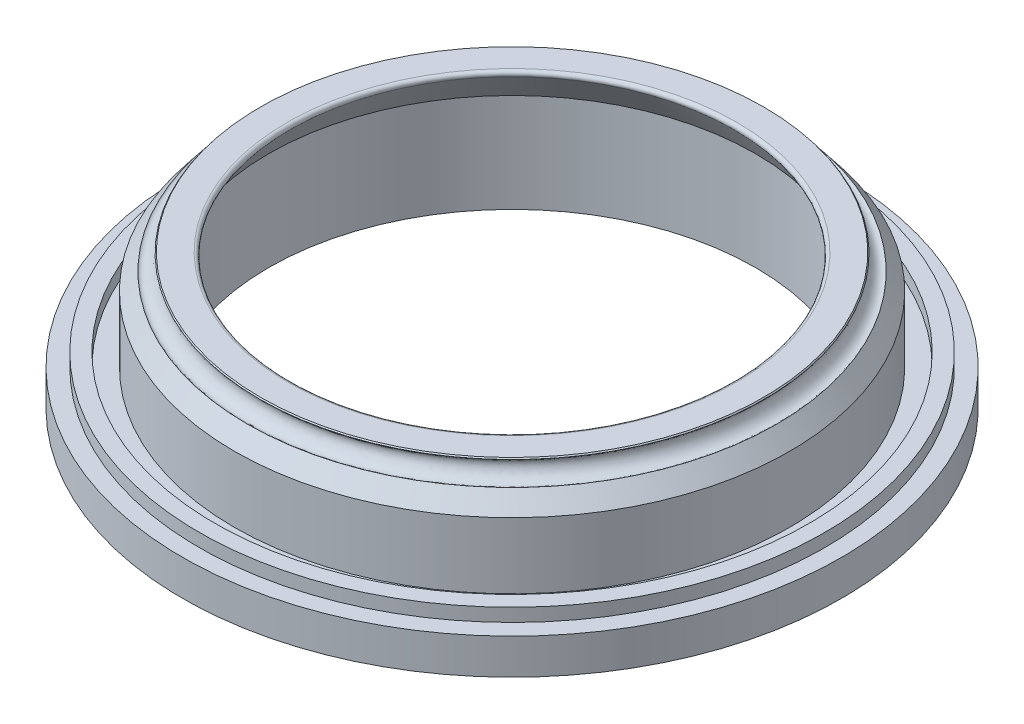
ISO-10303-21;
HEADER;
FILE_DESCRIPTION(('STEP AP214'),'2;1');
FILE_NAME('part.step','',(''),(''),'','','');
FILE_SCHEMA(('AUTOMOTIVE_DESIGN { 1 0 10303 214 1 1 1 1 }'));
ENDSEC;
DATA;
#1=APPLICATION_CONTEXT('core data for automotive mechanical design processes');
#2=APPLICATION_PROTOCOL_DEFINITION('international standard','automotive_design',2000,#1);
#3=PRODUCT_CONTEXT('',#1,'mechanical');
#4=PRODUCT('Part','Part','',(#3));
#5=PRODUCT_RELATED_PRODUCT_CATEGORY('part','',(#4));
#6=PRODUCT_DEFINITION_FORMATION('','',#4);
#7=PRODUCT_DEFINITION_CONTEXT('part definition',#1,'design');
#8=PRODUCT_DEFINITION('design','',#6,#7);
#9=PRODUCT_DEFINITION_SHAPE('','',#8);
#10=(LENGTH_UNIT() NAMED_UNIT(*) SI_UNIT(.MILLI.,.METRE.));
#11=(NAMED_UNIT(*) PLANE_ANGLE_UNIT() SI_UNIT($,.RADIAN.));
#12=(NAMED_UNIT(*) SI_UNIT($,.STERADIAN.) SOLID_ANGLE_UNIT());
#13=UNCERTAINTY_MEASURE_WITH_UNIT(LENGTH_MEASURE(1.E-05),#10,'distance_accuracy_value','');
#14=(GEOMETRIC_REPRESENTATION_CONTEXT(3) GLOBAL_UNCERTAINTY_ASSIGNED_CONTEXT((#13)) GLOBAL_UNIT_ASSIGNED_CONTEXT((#10,
#11,#12)) REPRESENTATION_CONTEXT('',''));
#15=CARTESIAN_POINT('',(0.,0.,0.));
#16=DIRECTION('',(0.,0.,1.));
#17=DIRECTION('',(1.,0.,0.));
#18=AXIS2_PLACEMENT_3D('',#15,#16,#17);
#19=CARTESIAN_POINT('',(78.7014235870721,-0.262378674365377,0.));
#20=DIRECTION('',(0.,0.,1.));
#21=DIRECTION('',(-1.,0.,0.));
#22=AXIS2_PLACEMENT_3D('',#19,#20,#21);
#23=ELLIPSE('',#22,3.,2.);
#24=CARTESIAN_POINT('',(0.,0.,0.));
#25=DIRECTION('',(0.,-1.,0.));
#26=AXIS1_PLACEMENT('',#24,#25);
#27=SURFACE_OF_REVOLUTION('',#23,#26);
#28=CARTESIAN_POINT('',(0.,-0.262378674365377,0.));
#29=DIRECTION('',(0.,-1.,0.));
#30=DIRECTION('',(0.,0.,-1.));
#31=AXIS2_PLACEMENT_3D('',#28,#29,#30);
#32=CIRCLE('',#31,75.701423587072);
#33=CARTESIAN_POINT('',(0.,-0.262378674365377,-75.701423587072));
#34=VERTEX_POINT('',#33);
#35=EDGE_CURVE('E97',#34,#34,#32,.T.);
#36=ORIENTED_EDGE('',*,*,#35,.F.);
#37=EDGE_LOOP('',(#36));
#38=FACE_BOUND('',#37,.T.);
#39=CARTESIAN_POINT('',(0.,-0.262378674365377,0.));
#40=DIRECTION('',(0.,-1.,0.));
#41=DIRECTION('',(0.,0.,-1.));
#42=AXIS2_PLACEMENT_3D('',#39,#40,#41);
#43=CIRCLE('',#42,81.7014235870721);
#44=CARTESIAN_POINT('',(0.,-0.262378674365377,-81.7014235870721));
#45=VERTEX_POINT('',#44);
#46=EDGE_CURVE('E52',#45,#45,#43,.T.);
#47=ORIENTED_EDGE('',*,*,#46,.T.);
#48=EDGE_LOOP('',(#47));
#49=FACE_BOUND('',#48,.T.);
#50=ADVANCED_FACE('F41',(#38,#49),#27,.T.);
#51=CARTESIAN_POINT('',(0.,-0.262378674365377,0.));
#52=DIRECTION('',(0.,-1.,0.));
#53=DIRECTION('',(0.,0.,-1.));
#54=AXIS2_PLACEMENT_3D('',#51,#52,#53);
#55=PLANE('',#54);
#56=CARTESIAN_POINT('',(0.,-0.262378674365377,85.));
#57=DIRECTION('',(0.,-1.,0.));
#58=DIRECTION('',(0.,0.,-1.));
#59=AXIS2_PLACEMENT_3D('',#56,#57,#58);
#60=CIRCLE('',#59,2.35);
#61=CARTESIAN_POINT('',(0.,-0.262378674365377,82.65));
#62=VERTEX_POINT('',#61);
#63=EDGE_CURVE('E277',#62,#62,#60,.T.);
#64=ORIENTED_EDGE('',*,*,#63,.F.);
#65=EDGE_LOOP('',(#64));
#66=FACE_BOUND('',#65,.T.);
#67=CARTESIAN_POINT('',(-42.4999999999991,-0.262378674365377,73.6121593216779));
#68=DIRECTION('',(0.,-1.,0.));
#69=DIRECTION('',(0.,0.,-1.));
#70=AXIS2_PLACEMENT_3D('',#67,#68,#69);
#71=CIRCLE('',#70,2.34999999999999);
#72=CARTESIAN_POINT('',(-42.4999999999991,-0.262378674365377,71.2621593216779));
#73=VERTEX_POINT('',#72);
#74=EDGE_CURVE('E296',#73,#73,#71,.T.);
#75=ORIENTED_EDGE('',*,*,#74,.F.);
#76=EDGE_LOOP('',(#75));
#77=FACE_BOUND('',#76,.T.);
#78=CARTESIAN_POINT('',(-73.6121593216768,-0.262378674365377,42.5000000000009));
#79=DIRECTION('',(0.,-1.,0.));
#80=DIRECTION('',(0.,0.,-1.));
#81=AXIS2_PLACEMENT_3D('',#78,#79,#80);
#82=CIRCLE('',#81,2.35);
#83=CARTESIAN_POINT('',(-73.6121593216768,-0.262378674365377,40.1500000000009));
#84=VERTEX_POINT('',#83);
#85=EDGE_CURVE('E290',#84,#84,#82,.T.);
#86=ORIENTED_EDGE('',*,*,#85,.F.);
#87=EDGE_LOOP('',(#86));
#88=FACE_BOUND('',#87,.T.);
#89=CARTESIAN_POINT('',(-85.,-0.262378674365377,8.90327741404999E-13));
#90=DIRECTION('',(0.,-1.,0.));
#91=DIRECTION('',(0.,0.,-1.));
#92=AXIS2_PLACEMENT_3D('',#89,#90,#91);
#93=CIRCLE('',#92,2.35);
#94=CARTESIAN_POINT('',(-85.,-0.262378674365377,-2.34999999999911));
#95=VERTEX_POINT('',#94);
#96=EDGE_CURVE('E283',#95,#95,#93,.T.);
#97=ORIENTED_EDGE('',*,*,#96,.F.);
#98=EDGE_LOOP('',(#97));
#99=FACE_BOUND('',#98,.T.);
#100=CARTESIAN_POINT('',(42.5000000000001,-0.262378674365377,73.6121593216773));
#101=DIRECTION('',(0.,-1.,0.));
#102=DIRECTION('',(0.,0.,-1.));
#103=AXIS2_PLACEMENT_3D('',#100,#101,#102);
#104=CIRCLE('',#103,2.35000000000001);
#105=CARTESIAN_POINT('',(42.5000000000001,-0.262378674365377,71.2621593216772));
#106=VERTEX_POINT('',#105);
#107=EDGE_CURVE('E280',#106,#106,#104,.T.);
#108=ORIENTED_EDGE('',*,*,#107,.F.);
#109=EDGE_LOOP('',(#108));
#110=FACE_BOUND('',#109,.T.);
#111=CARTESIAN_POINT('',(73.6121593216774,-0.262378674365377,42.4999999999998));
#112=DIRECTION('',(0.,-1.,0.));
#113=DIRECTION('',(0.,0.,-1.));
#114=AXIS2_PLACEMENT_3D('',#111,#112,#113);
#115=CIRCLE('',#114,2.35000000000001);
#116=CARTESIAN_POINT('',(73.6121593216774,-0.262378674365377,40.1499999999998));
#117=VERTEX_POINT('',#116);
#118=EDGE_CURVE('E331',#117,#117,#115,.T.);
#119=ORIENTED_EDGE('',*,*,#118,.F.);
#120=EDGE_LOOP('',(#119));
#121=FACE_BOUND('',#120,.T.);
#122=CARTESIAN_POINT('',(85.,-0.262378674365377,-2.96775913801666E-13));
#123=DIRECTION('',(0.,-1.,0.));
#124=DIRECTION('',(0.,0.,-1.));
#125=AXIS2_PLACEMENT_3D('',#122,#123,#124);
#126=CIRCLE('',#125,2.35);
#127=CARTESIAN_POINT('',(85.,-0.262378674365377,-2.3500000000003));
#128=VERTEX_POINT('',#127);
#129=EDGE_CURVE('E337',#128,#128,#126,.T.);
#130=ORIENTED_EDGE('',*,*,#129,.F.);
#131=EDGE_LOOP('',(#130));
#132=FACE_BOUND('',#131,.T.);
#133=CARTESIAN_POINT('',(73.6121593216771,-0.262378674365377,-42.5000000000003));
#134=DIRECTION('',(0.,-1.,0.));
#135=DIRECTION('',(0.,0.,-1.));
#136=AXIS2_PLACEMENT_3D('',#133,#134,#135);
#137=CIRCLE('',#136,2.35000000000001);
#138=CARTESIAN_POINT('',(73.6121593216771,-0.262378674365377,-44.8500000000003));
#139=VERTEX_POINT('',#138);
#140=EDGE_CURVE('E343',#139,#139,#137,.T.);
#141=ORIENTED_EDGE('',*,*,#140,.F.);
#142=EDGE_LOOP('',(#141));
#143=FACE_BOUND('',#142,.T.);
#144=CARTESIAN_POINT('',(42.4999999999996,-0.262378674365377,-73.6121593216776));
#145=DIRECTION('',(0.,-1.,0.));
#146=DIRECTION('',(0.,0.,-1.));
#147=AXIS2_PLACEMENT_3D('',#144,#145,#146);
#148=CIRCLE('',#147,2.34999999999999);
#149=CARTESIAN_POINT('',(42.4999999999996,-0.262378674365377,-75.9621593216775));
#150=VERTEX_POINT('',#149);
#151=EDGE_CURVE('E302',#150,#150,#148,.T.);
#152=ORIENTED_EDGE('',*,*,#151,.F.);
#153=EDGE_LOOP('',(#152));
#154=FACE_BOUND('',#153,.T.);
#155=CARTESIAN_POINT('',(-5.93551827603333E-13,-0.262378674365377,-85.));
#156=DIRECTION('',(0.,-1.,0.));
#157=DIRECTION('',(0.,0.,-1.));
#158=AXIS2_PLACEMENT_3D('',#155,#156,#157);
#159=CIRCLE('',#158,2.35);
#160=CARTESIAN_POINT('',(-5.93551827603333E-13,-0.262378674365377,-87.35));
#161=VERTEX_POINT('',#160);
#162=EDGE_CURVE('E309',#161,#161,#159,.T.);
#163=ORIENTED_EDGE('',*,*,#162,.F.);
#164=EDGE_LOOP('',(#163));
#165=FACE_BOUND('',#164,.T.);
#166=CARTESIAN_POINT('',(-42.5000000000006,-0.262378674365377,-73.6121593216769));
#167=DIRECTION('',(0.,-1.,0.));
#168=DIRECTION('',(0.,0.,-1.));
#169=AXIS2_PLACEMENT_3D('',#166,#167,#168);
#170=CIRCLE('',#169,2.35);
#171=CARTESIAN_POINT('',(-42.5000000000006,-0.262378674365377,-75.9621593216769));
#172=VERTEX_POINT('',#171);
#173=EDGE_CURVE('E315',#172,#172,#170,.T.);
#174=ORIENTED_EDGE('',*,*,#173,.F.);
#175=EDGE_LOOP('',(#174));
#176=FACE_BOUND('',#175,.T.);
#177=CARTESIAN_POINT('',(-73.6121593216777,-0.262378674365377,-42.4999999999993));
#178=DIRECTION('',(0.,-1.,0.));
#179=DIRECTION('',(0.,0.,-1.));
#180=AXIS2_PLACEMENT_3D('',#177,#178,#179);
#181=CIRCLE('',#180,2.35);
#182=CARTESIAN_POINT('',(-73.6121593216777,-0.262378674365377,-44.8499999999993));
#183=VERTEX_POINT('',#182);
#184=EDGE_CURVE('E321',#183,#183,#181,.T.);
#185=ORIENTED_EDGE('',*,*,#184,.F.);
#186=EDGE_LOOP('',(#185));
#187=FACE_BOUND('',#186,.T.);
#188=CARTESIAN_POINT('',(0.,-0.262378674365377,0.));
#189=DIRECTION('',(0.,-1.,0.));
#190=DIRECTION('',(0.,0.,-1.));
#191=AXIS2_PLACEMENT_3D('',#188,#189,#190);
#192=CIRCLE('',#191,100.);
#193=CARTESIAN_POINT('',(0.,-0.262378674365377,-100.));
#194=VERTEX_POINT('',#193);
#195=EDGE_CURVE('E56',#194,#194,#192,.T.);
#196=ORIENTED_EDGE('',*,*,#195,.T.);
#197=EDGE_LOOP('',(#196));
#198=FACE_BOUND('',#197,.T.);
#199=ORIENTED_EDGE('',*,*,#46,.F.);
#200=EDGE_LOOP('',(#199));
#201=FACE_BOUND('',#200,.T.);
#202=ADVANCED_FACE('F143',(#66,#77,#88,#99,#110,#121,#132,#143,#154,#165,#176,#187,#198,#201),
#55,.T.);
#203=CARTESIAN_POINT('',(0.,0.,0.));
#204=DIRECTION('',(0.,-1.,0.));
#205=DIRECTION('',(0.,0.,-1.));
#206=AXIS2_PLACEMENT_3D('',#203,#204,#205);
#207=CYLINDRICAL_SURFACE('',#206,100.);
#208=ORIENTED_EDGE('',*,*,#195,.F.);
#209=EDGE_LOOP('',(#208));
#210=FACE_BOUND('',#209,.T.);
#211=CARTESIAN_POINT('',(0.,10.5257606573878,0.));
#212=DIRECTION('',(0.,-1.,0.));
#213=DIRECTION('',(0.,0.,-1.));
#214=AXIS2_PLACEMENT_3D('',#211,#212,#213);
#215=CIRCLE('',#214,100.);
#216=CARTESIAN_POINT('',(0.,10.5257606573878,-100.));
#217=VERTEX_POINT('',#216);
#218=EDGE_CURVE('E61',#217,#217,#215,.T.);
#219=ORIENTED_EDGE('',*,*,#218,.T.);
#220=EDGE_LOOP('',(#219));
#221=FACE_BOUND('',#220,.T.);
#222=ADVANCED_FACE('F140',(#210,#221),#207,.T.);
#223=CARTESIAN_POINT('',(0.,10.5257606573878,0.));
#224=DIRECTION('',(0.,-1.,0.));
#225=DIRECTION('',(0.,0.,-1.));
#226=AXIS2_PLACEMENT_3D('',#223,#224,#225);
#227=PLANE('',#226);
#228=ORIENTED_EDGE('',*,*,#218,.F.);
#229=EDGE_LOOP('',(#228));
#230=FACE_BOUND('',#229,.T.);
#231=CARTESIAN_POINT('',(0.,10.5257606573878,0.));
#232=DIRECTION('',(0.,-1.,0.));
#233=DIRECTION('',(0.,0.,-1.));
#234=AXIS2_PLACEMENT_3D('',#231,#232,#233);
#235=CIRCLE('',#234,94.9);
#236=CARTESIAN_POINT('',(0.,10.5257606573878,-94.9));
#237=VERTEX_POINT('',#236);
#238=EDGE_CURVE('E64',#237,#237,#235,.T.);
#239=ORIENTED_EDGE('',*,*,#238,.T.);
#240=EDGE_LOOP('',(#239));
#241=FACE_BOUND('',#240,.T.);
#242=ADVANCED_FACE('F136',(#230,#241),#227,.F.);
#243=CARTESIAN_POINT('',(0.,0.,0.));
#244=DIRECTION('',(0.,-1.,0.));
#245=DIRECTION('',(0.,0.,-1.));
#246=AXIS2_PLACEMENT_3D('',#243,#244,#245);
#247=CYLINDRICAL_SURFACE('',#246,94.9);
#248=ORIENTED_EDGE('',*,*,#238,.F.);
#249=EDGE_LOOP('',(#248));
#250=FACE_BOUND('',#249,.T.);
#251=CARTESIAN_POINT('',(0.,14.5257606573878,0.));
#252=DIRECTION('',(0.,-1.,0.));
#253=DIRECTION('',(0.,0.,-1.));
#254=AXIS2_PLACEMENT_3D('',#251,#252,#253);
#255=CIRCLE('',#254,94.9);
#256=CARTESIAN_POINT('',(0.,14.5257606573878,-94.9));
#257=VERTEX_POINT('',#256);
#258=EDGE_CURVE('E67',#257,#257,#255,.T.);
#259=ORIENTED_EDGE('',*,*,#258,.T.);
#260=EDGE_LOOP('',(#259));
#261=FACE_BOUND('',#260,.T.);
#262=ADVANCED_FACE('F132',(#250,#261),#247,.T.);
#263=CARTESIAN_POINT('',(0.,14.5257606573878,0.));
#264=DIRECTION('',(0.,-1.,0.));
#265=DIRECTION('',(0.,0.,-1.));
#266=AXIS2_PLACEMENT_3D('',#263,#264,#265);
#267=PLANE('',#266);
#268=ORIENTED_EDGE('',*,*,#258,.F.);
#269=EDGE_LOOP('',(#268));
#270=FACE_BOUND('',#269,.T.);
#271=CARTESIAN_POINT('',(0.,14.5257606573878,0.));
#272=DIRECTION('',(0.,-1.,0.));
#273=DIRECTION('',(0.,0.,-1.));
#274=AXIS2_PLACEMENT_3D('',#271,#272,#273);
#275=CIRCLE('',#274,90.15);
#276=CARTESIAN_POINT('',(0.,14.5257606573878,-90.15));
#277=VERTEX_POINT('',#276);
#278=EDGE_CURVE('E70',#277,#277,#275,.T.);
#279=ORIENTED_EDGE('',*,*,#278,.T.);
#280=EDGE_LOOP('',(#279));
#281=FACE_BOUND('',#280,.T.);
#282=ADVANCED_FACE('F128',(#270,#281),#267,.F.);
#283=CARTESIAN_POINT('',(0.,0.,0.));
#284=DIRECTION('',(0.,-1.,0.));
#285=DIRECTION('',(0.,0.,-1.));
#286=AXIS2_PLACEMENT_3D('',#283,#284,#285);
#287=CYLINDRICAL_SURFACE('',#286,90.15);
#288=ORIENTED_EDGE('',*,*,#278,.F.);
#289=EDGE_LOOP('',(#288));
#290=FACE_BOUND('',#289,.T.);
#291=CARTESIAN_POINT('',(0.,10.5257606573878,0.));
#292=DIRECTION('',(0.,-1.,0.));
#293=DIRECTION('',(0.,0.,-1.));
#294=AXIS2_PLACEMENT_3D('',#291,#292,#293);
#295=CIRCLE('',#294,90.15);
#296=CARTESIAN_POINT('',(0.,10.5257606573878,-90.15));
#297=VERTEX_POINT('',#296);
#298=EDGE_CURVE('E73',#297,#297,#295,.T.);
#299=ORIENTED_EDGE('',*,*,#298,.T.);
#300=EDGE_LOOP('',(#299));
#301=FACE_BOUND('',#300,.T.);
#302=ADVANCED_FACE('F124',(#290,#301),#287,.F.);
#303=CARTESIAN_POINT('',(0.,10.5257606573878,0.));
#304=DIRECTION('',(0.,-1.,0.));
#305=DIRECTION('',(0.,0.,-1.));
#306=AXIS2_PLACEMENT_3D('',#303,#304,#305);
#307=PLANE('',#306);
#308=ORIENTED_EDGE('',*,*,#298,.F.);
#309=EDGE_LOOP('',(#308));
#310=FACE_BOUND('',#309,.T.);
#311=CARTESIAN_POINT('',(0.,10.5257606573878,0.));
#312=DIRECTION('',(0.,-1.,0.));
#313=DIRECTION('',(0.,0.,-1.));
#314=AXIS2_PLACEMENT_3D('',#311,#312,#313);
#315=CIRCLE('',#314,84.25);
#316=CARTESIAN_POINT('',(0.,10.5257606573878,-84.25));
#317=VERTEX_POINT('',#316);
#318=EDGE_CURVE('E76',#317,#317,#315,.T.);
#319=ORIENTED_EDGE('',*,*,#318,.T.);
#320=EDGE_LOOP('',(#319));
#321=FACE_BOUND('',#320,.T.);
#322=ADVANCED_FACE('F120',(#310,#321),#307,.F.);
#323=CARTESIAN_POINT('',(0.,0.,0.));
#324=DIRECTION('',(0.,-1.,0.));
#325=DIRECTION('',(0.,0.,-1.));
#326=AXIS2_PLACEMENT_3D('',#323,#324,#325);
#327=CYLINDRICAL_SURFACE('',#326,84.25);
#328=ORIENTED_EDGE('',*,*,#318,.F.);
#329=EDGE_LOOP('',(#328));
#330=FACE_BOUND('',#329,.T.);
#331=CARTESIAN_POINT('',(0.,30.5257606573879,0.));
#332=DIRECTION('',(0.,-1.,0.));
#333=DIRECTION('',(0.,0.,-1.));
#334=AXIS2_PLACEMENT_3D('',#331,#332,#333);
#335=CIRCLE('',#334,84.25);
#336=CARTESIAN_POINT('',(0.,30.5257606573879,-84.25));
#337=VERTEX_POINT('',#336);
#338=EDGE_CURVE('E79',#337,#337,#335,.T.);
#339=ORIENTED_EDGE('',*,*,#338,.T.);
#340=EDGE_LOOP('',(#339));
#341=FACE_BOUND('',#340,.T.);
#342=ADVANCED_FACE('F116',(#330,#341),#327,.T.);
#343=CARTESIAN_POINT('',(0.,35.6546539299251,0.));
#344=DIRECTION('',(0.,-1.,0.));
#345=DIRECTION('',(0.,0.,-1.));
#346=AXIS2_PLACEMENT_3D('',#343,#344,#345);
#347=CONICAL_SURFACE('',#346,80.2744893178467,0.659385391403463);
#348=ORIENTED_EDGE('',*,*,#338,.F.);
#349=EDGE_LOOP('',(#348));
#350=FACE_BOUND('',#349,.T.);
#351=CARTESIAN_POINT('',(0.,35.6546539299251,0.));
#352=DIRECTION('',(0.,-1.,0.));
#353=DIRECTION('',(0.,0.,-1.));
#354=AXIS2_PLACEMENT_3D('',#351,#352,#353);
#355=CIRCLE('',#354,80.2744893178467);
#356=CARTESIAN_POINT('',(0.,35.6546539299251,-80.2744893178467));
#357=VERTEX_POINT('',#356);
#358=EDGE_CURVE('E82',#357,#357,#355,.T.);
#359=ORIENTED_EDGE('',*,*,#358,.T.);
#360=EDGE_LOOP('',(#359));
#361=FACE_BOUND('',#360,.T.);
#362=ADVANCED_FACE('F111',(#350,#361),#347,.T.);
#363=CARTESIAN_POINT('',(78.4365957172863,38.0257606573879,0.));
#364=DIRECTION('',(0.,0.,1.));
#365=DIRECTION('',(0.6126312001868,-0.790368909154251,0.));
#366=AXIS2_PLACEMENT_3D('',#363,#364,#365);
#367=ELLIPSE('',#366,3.,2.);
#368=CARTESIAN_POINT('',(0.,0.,0.));
#369=DIRECTION('',(0.,-1.,0.));
#370=AXIS1_PLACEMENT('',#368,#369);
#371=SURFACE_OF_REVOLUTION('',#367,#370);
#372=ORIENTED_EDGE('',*,*,#358,.F.);
#373=EDGE_LOOP('',(#372));
#374=FACE_BOUND('',#373,.T.);
#375=CARTESIAN_POINT('',(0.,40.3968673848506,0.));
#376=DIRECTION('',(0.,-1.,0.));
#377=DIRECTION('',(0.,0.,-1.));
#378=AXIS2_PLACEMENT_3D('',#375,#376,#377);
#379=CIRCLE('',#378,76.5987021167259);
#380=CARTESIAN_POINT('',(0.,40.3968673848506,-76.5987021167259));
#381=VERTEX_POINT('',#380);
#382=EDGE_CURVE('E85',#381,#381,#379,.T.);
#383=ORIENTED_EDGE('',*,*,#382,.T.);
#384=EDGE_LOOP('',(#383));
#385=FACE_BOUND('',#384,.T.);
#386=ADVANCED_FACE('F106',(#374,#385),#371,.T.);
#387=CARTESIAN_POINT('',(0.,40.74810371,0.));
#388=DIRECTION('',(0.,-1.,0.));
#389=DIRECTION('',(0.,0.,-1.));
#390=AXIS2_PLACEMENT_3D('',#387,#388,#389);
#391=CONICAL_SURFACE('',#390,76.3264516158101,0.659385391403478);
#392=ORIENTED_EDGE('',*,*,#382,.F.);
#393=EDGE_LOOP('',(#392));
#394=FACE_BOUND('',#393,.T.);
#395=CARTESIAN_POINT('',(0.,40.74810371,0.));
#396=DIRECTION('',(0.,-1.,0.));
#397=DIRECTION('',(0.,0.,-1.));
#398=AXIS2_PLACEMENT_3D('',#395,#396,#397);
#399=CIRCLE('',#398,76.3264516158101);
#400=CARTESIAN_POINT('',(0.,40.74810371,-76.3264516158101));
#401=VERTEX_POINT('',#400);
#402=EDGE_CURVE('E88',#401,#401,#399,.T.);
#403=ORIENTED_EDGE('',*,*,#402,.T.);
#404=EDGE_LOOP('',(#403));
#405=FACE_BOUND('',#404,.T.);
#406=ADVANCED_FACE('F110',(#394,#405),#391,.T.);
#407=CARTESIAN_POINT('',(0.,40.74810371,0.));
#408=DIRECTION('',(0.,-1.,0.));
#409=DIRECTION('',(0.,0.,-1.));
#410=AXIS2_PLACEMENT_3D('',#407,#408,#409);
#411=PLANE('',#410);
#412=CARTESIAN_POINT('',(0.,40.74810371,0.));
#413=DIRECTION('',(0.,-1.,0.));
#414=DIRECTION('',(0.,0.,-1.));
#415=AXIS2_PLACEMENT_3D('',#412,#413,#414);
#416=CIRCLE('',#415,68.2179773977924);
#417=CARTESIAN_POINT('',(0.,40.74810371,-68.2179773977924));
#418=VERTEX_POINT('',#417);
#419=EDGE_CURVE('E48',#418,#418,#416,.T.);
#420=ORIENTED_EDGE('',*,*,#419,.T.);
#421=EDGE_LOOP('',(#420));
#422=FACE_BOUND('',#421,.T.);
#423=ORIENTED_EDGE('',*,*,#402,.F.);
#424=EDGE_LOOP('',(#423));
#425=FACE_BOUND('',#424,.T.);
#426=ADVANCED_FACE('F171',(#422,#425),#411,.F.);
#427=CARTESIAN_POINT('',(0.,40.74810371,0.));
#428=DIRECTION('',(0.,-1.,0.));
#429=DIRECTION('',(0.,0.,-1.));
#430=AXIS2_PLACEMENT_3D('',#427,#428,#429);
#431=CONICAL_SURFACE('',#430,66.3264516158101,0.598151137095569);
#432=CARTESIAN_POINT('',(0.,39.1849881331945,0.));
#433=DIRECTION('',(0.,-1.,0.));
#434=DIRECTION('',(0.,0.,-1.));
#435=AXIS2_PLACEMENT_3D('',#432,#433,#434);
#436=CIRCLE('',#435,67.3915992475736);
#437=CARTESIAN_POINT('',(0.,39.1849881331945,-67.3915992475736));
#438=VERTEX_POINT('',#437);
#439=EDGE_CURVE('E10',#438,#438,#436,.F.);
#440=ORIENTED_EDGE('',*,*,#439,.T.);
#441=EDGE_LOOP('',(#440));
#442=FACE_BOUND('',#441,.T.);
#443=CARTESIAN_POINT('',(0.,29.6746638875515,0.));
#444=DIRECTION('',(0.,-1.,0.));
#445=DIRECTION('',(0.,0.,-1.));
#446=AXIS2_PLACEMENT_3D('',#443,#444,#445);
#447=CIRCLE('',#446,73.8721816804167);
#448=CARTESIAN_POINT('',(0.,29.6746638875515,-73.8721816804167));
#449=VERTEX_POINT('',#448);
#450=EDGE_CURVE('E91',#449,#449,#447,.T.);
#451=ORIENTED_EDGE('',*,*,#450,.T.);
#452=EDGE_LOOP('',(#451));
#453=FACE_BOUND('',#452,.T.);
#454=ADVANCED_FACE('F166',(#442,#453),#431,.F.);
#455=CARTESIAN_POINT('',(0.,0.,0.));
#456=DIRECTION('',(0.,-1.,0.));
#457=DIRECTION('',(0.,0.,-1.));
#458=AXIS2_PLACEMENT_3D('',#455,#456,#457);
#459=CYLINDRICAL_SURFACE('',#458,73.8721816804167);
#460=CARTESIAN_POINT('',(0.,-0.262378674365377,0.));
#461=DIRECTION('',(0.,-1.,0.));
#462=DIRECTION('',(0.,0.,-1.));
#463=AXIS2_PLACEMENT_3D('',#460,#461,#462);
#464=CIRCLE('',#463,73.8721816804167);
#465=CARTESIAN_POINT('',(0.,-0.262378674365377,-73.8721816804167));
#466=VERTEX_POINT('',#465);
#467=EDGE_CURVE('E94',#466,#466,#464,.T.);
#468=ORIENTED_EDGE('',*,*,#467,.T.);
#469=EDGE_LOOP('',(#468));
#470=FACE_BOUND('',#469,.T.);
#471=ORIENTED_EDGE('',*,*,#450,.F.);
#472=EDGE_LOOP('',(#471));
#473=FACE_BOUND('',#472,.T.);
#474=ADVANCED_FACE('F161',(#470,#473),#459,.F.);
#475=ORIENTED_EDGE('',*,*,#35,.T.);
#476=EDGE_LOOP('',(#475));
#477=FACE_BOUND('',#476,.T.);
#478=ORIENTED_EDGE('',*,*,#467,.F.);
#479=EDGE_LOOP('',(#478));
#480=FACE_BOUND('',#479,.T.);
#481=ADVANCED_FACE('F152',(#477,#480),#55,.T.);
#482=CARTESIAN_POINT('',(-73.6121593216777,4.73762132563462,-42.4999999999993));
#483=DIRECTION('',(0.,-1.,0.));
#484=DIRECTION('',(0.,0.,-1.));
#485=AXIS2_PLACEMENT_3D('',#482,#483,#484);
#486=CYLINDRICAL_SURFACE('',#485,2.35);
#487=CARTESIAN_POINT('',(-73.6121593216777,4.73762132563462,-42.4999999999993));
#488=DIRECTION('',(0.,-1.,0.));
#489=DIRECTION('',(0.,0.,-1.));
#490=AXIS2_PLACEMENT_3D('',#487,#488,#489);
#491=CIRCLE('',#490,2.35);
#492=CARTESIAN_POINT('',(-73.6121593216777,4.73762132563462,-44.8499999999993));
#493=VERTEX_POINT('',#492);
#494=EDGE_CURVE('E286',#493,#493,#491,.T.);
#495=ORIENTED_EDGE('',*,*,#494,.F.);
#496=EDGE_LOOP('',(#495));
#497=FACE_BOUND('',#496,.T.);
#498=ORIENTED_EDGE('',*,*,#184,.T.);
#499=EDGE_LOOP('',(#498));
#500=FACE_BOUND('',#499,.T.);
#501=ADVANCED_FACE('F160',(#497,#500),#486,.F.);
#502=CARTESIAN_POINT('',(-73.6121593216777,4.73762132563462,-42.4999999999993));
#503=DIRECTION('',(0.,-1.,0.));
#504=DIRECTION('',(0.,0.,-1.));
#505=AXIS2_PLACEMENT_3D('',#502,#503,#504);
#506=PLANE('',#505);
#507=ORIENTED_EDGE('',*,*,#494,.T.);
#508=EDGE_LOOP('',(#507));
#509=FACE_BOUND('',#508,.T.);
#510=ADVANCED_FACE('F212',(#509),#506,.T.);
#511=CARTESIAN_POINT('',(-42.5000000000006,4.73762132563462,-73.6121593216769));
#512=DIRECTION('',(0.,-1.,0.));
#513=DIRECTION('',(0.,0.,-1.));
#514=AXIS2_PLACEMENT_3D('',#511,#512,#513);
#515=CYLINDRICAL_SURFACE('',#514,2.35);
#516=CARTESIAN_POINT('',(-42.5000000000006,4.73762132563462,-73.6121593216769));
#517=DIRECTION('',(0.,-1.,0.));
#518=DIRECTION('',(0.,0.,-1.));
#519=AXIS2_PLACEMENT_3D('',#516,#517,#518);
#520=CIRCLE('',#519,2.35);
#521=CARTESIAN_POINT('',(-42.5000000000006,4.73762132563462,-75.9621593216769));
#522=VERTEX_POINT('',#521);
#523=EDGE_CURVE('E318',#522,#522,#520,.T.);
#524=ORIENTED_EDGE('',*,*,#523,.F.);
#525=EDGE_LOOP('',(#524));
#526=FACE_BOUND('',#525,.T.);
#527=ORIENTED_EDGE('',*,*,#173,.T.);
#528=EDGE_LOOP('',(#527));
#529=FACE_BOUND('',#528,.T.);
#530=ADVANCED_FACE('F215',(#526,#529),#515,.F.);
#531=CARTESIAN_POINT('',(-42.5000000000006,4.73762132563462,-73.6121593216769));
#532=DIRECTION('',(0.,-1.,0.));
#533=DIRECTION('',(0.,0.,-1.));
#534=AXIS2_PLACEMENT_3D('',#531,#532,#533);
#535=PLANE('',#534);
#536=ORIENTED_EDGE('',*,*,#523,.T.);
#537=EDGE_LOOP('',(#536));
#538=FACE_BOUND('',#537,.T.);
#539=ADVANCED_FACE('F220',(#538),#535,.T.);
#540=CARTESIAN_POINT('',(-5.93551827603333E-13,4.73762132563462,-85.));
#541=DIRECTION('',(0.,-1.,0.));
#542=DIRECTION('',(0.,0.,-1.));
#543=AXIS2_PLACEMENT_3D('',#540,#541,#542);
#544=CYLINDRICAL_SURFACE('',#543,2.35);
#545=CARTESIAN_POINT('',(-5.93551827603333E-13,4.73762132563462,-85.));
#546=DIRECTION('',(0.,-1.,0.));
#547=DIRECTION('',(0.,0.,-1.));
#548=AXIS2_PLACEMENT_3D('',#545,#546,#547);
#549=CIRCLE('',#548,2.35);
#550=CARTESIAN_POINT('',(-5.93551827603333E-13,4.73762132563462,-87.35));
#551=VERTEX_POINT('',#550);
#552=EDGE_CURVE('E312',#551,#551,#549,.T.);
#553=ORIENTED_EDGE('',*,*,#552,.F.);
#554=EDGE_LOOP('',(#553));
#555=FACE_BOUND('',#554,.T.);
#556=ORIENTED_EDGE('',*,*,#162,.T.);
#557=EDGE_LOOP('',(#556));
#558=FACE_BOUND('',#557,.T.);
#559=ADVANCED_FACE('F223',(#555,#558),#544,.F.);
#560=CARTESIAN_POINT('',(-5.93551827603333E-13,4.73762132563462,-85.));
#561=DIRECTION('',(0.,-1.,0.));
#562=DIRECTION('',(0.,0.,-1.));
#563=AXIS2_PLACEMENT_3D('',#560,#561,#562);
#564=PLANE('',#563);
#565=ORIENTED_EDGE('',*,*,#552,.T.);
#566=EDGE_LOOP('',(#565));
#567=FACE_BOUND('',#566,.T.);
#568=ADVANCED_FACE('F228',(#567),#564,.T.);
#569=CARTESIAN_POINT('',(42.4999999999996,4.73762132563462,-73.6121593216776));
#570=DIRECTION('',(0.,-1.,0.));
#571=DIRECTION('',(0.,0.,-1.));
#572=AXIS2_PLACEMENT_3D('',#569,#570,#571);
#573=CYLINDRICAL_SURFACE('',#572,2.34999999999999);
#574=CARTESIAN_POINT('',(42.4999999999996,4.73762132563462,-73.6121593216776));
#575=DIRECTION('',(0.,-1.,0.));
#576=DIRECTION('',(0.,0.,-1.));
#577=AXIS2_PLACEMENT_3D('',#574,#575,#576);
#578=CIRCLE('',#577,2.34999999999999);
#579=CARTESIAN_POINT('',(42.4999999999996,4.73762132563462,-75.9621593216775));
#580=VERTEX_POINT('',#579);
#581=EDGE_CURVE('E306',#580,#580,#578,.T.);
#582=ORIENTED_EDGE('',*,*,#581,.F.);
#583=EDGE_LOOP('',(#582));
#584=FACE_BOUND('',#583,.T.);
#585=ORIENTED_EDGE('',*,*,#151,.T.);
#586=EDGE_LOOP('',(#585));
#587=FACE_BOUND('',#586,.T.);
#588=ADVANCED_FACE('F231',(#584,#587),#573,.F.);
#589=CARTESIAN_POINT('',(42.4999999999996,4.73762132563462,-73.6121593216776));
#590=DIRECTION('',(0.,-1.,0.));
#591=DIRECTION('',(0.,0.,-1.));
#592=AXIS2_PLACEMENT_3D('',#589,#590,#591);
#593=PLANE('',#592);
#594=ORIENTED_EDGE('',*,*,#581,.T.);
#595=EDGE_LOOP('',(#594));
#596=FACE_BOUND('',#595,.T.);
#597=ADVANCED_FACE('F186',(#596),#593,.T.);
#598=CARTESIAN_POINT('',(73.6121593216771,4.73762132563462,-42.5000000000003));
#599=DIRECTION('',(0.,-1.,0.));
#600=DIRECTION('',(0.,0.,-1.));
#601=AXIS2_PLACEMENT_3D('',#598,#599,#600);
#602=CYLINDRICAL_SURFACE('',#601,2.35000000000001);
#603=CARTESIAN_POINT('',(73.6121593216771,4.73762132563462,-42.5000000000003));
#604=DIRECTION('',(0.,-1.,0.));
#605=DIRECTION('',(0.,0.,-1.));
#606=AXIS2_PLACEMENT_3D('',#603,#604,#605);
#607=CIRCLE('',#606,2.35000000000001);
#608=CARTESIAN_POINT('',(73.6121593216771,4.73762132563462,-44.8500000000003));
#609=VERTEX_POINT('',#608);
#610=EDGE_CURVE('E305',#609,#609,#607,.T.);
#611=ORIENTED_EDGE('',*,*,#610,.F.);
#612=EDGE_LOOP('',(#611));
#613=FACE_BOUND('',#612,.T.);
#614=ORIENTED_EDGE('',*,*,#140,.T.);
#615=EDGE_LOOP('',(#614));
#616=FACE_BOUND('',#615,.T.);
#617=ADVANCED_FACE('F182',(#613,#616),#602,.F.);
#618=CARTESIAN_POINT('',(73.6121593216771,4.73762132563462,-42.5000000000003));
#619=DIRECTION('',(0.,-1.,0.));
#620=DIRECTION('',(0.,0.,-1.));
#621=AXIS2_PLACEMENT_3D('',#618,#619,#620);
#622=PLANE('',#621);
#623=ORIENTED_EDGE('',*,*,#610,.T.);
#624=EDGE_LOOP('',(#623));
#625=FACE_BOUND('',#624,.T.);
#626=ADVANCED_FACE('F178',(#625),#622,.T.);
#627=CARTESIAN_POINT('',(85.,4.73762132563462,-2.96775913801666E-13));
#628=DIRECTION('',(0.,-1.,0.));
#629=DIRECTION('',(0.,0.,-1.));
#630=AXIS2_PLACEMENT_3D('',#627,#628,#629);
#631=CYLINDRICAL_SURFACE('',#630,2.35);
#632=CARTESIAN_POINT('',(85.,4.73762132563462,-2.96775913801666E-13));
#633=DIRECTION('',(0.,-1.,0.));
#634=DIRECTION('',(0.,0.,-1.));
#635=AXIS2_PLACEMENT_3D('',#632,#633,#634);
#636=CIRCLE('',#635,2.35);
#637=CARTESIAN_POINT('',(85.,4.73762132563462,-2.3500000000003));
#638=VERTEX_POINT('',#637);
#639=EDGE_CURVE('E340',#638,#638,#636,.T.);
#640=ORIENTED_EDGE('',*,*,#639,.F.);
#641=EDGE_LOOP('',(#640));
#642=FACE_BOUND('',#641,.T.);
#643=ORIENTED_EDGE('',*,*,#129,.T.);
#644=EDGE_LOOP('',(#643));
#645=FACE_BOUND('',#644,.T.);
#646=ADVANCED_FACE('F181',(#642,#645),#631,.F.);
#647=CARTESIAN_POINT('',(85.,4.73762132563462,-2.96775913801666E-13));
#648=DIRECTION('',(0.,-1.,0.));
#649=DIRECTION('',(0.,0.,-1.));
#650=AXIS2_PLACEMENT_3D('',#647,#648,#649);
#651=PLANE('',#650);
#652=ORIENTED_EDGE('',*,*,#639,.T.);
#653=EDGE_LOOP('',(#652));
#654=FACE_BOUND('',#653,.T.);
#655=ADVANCED_FACE('F188',(#654),#651,.T.);
#656=CARTESIAN_POINT('',(73.6121593216774,4.73762132563462,42.4999999999998));
#657=DIRECTION('',(0.,-1.,0.));
#658=DIRECTION('',(0.,0.,-1.));
#659=AXIS2_PLACEMENT_3D('',#656,#657,#658);
#660=CYLINDRICAL_SURFACE('',#659,2.35000000000001);
#661=CARTESIAN_POINT('',(73.6121593216774,4.73762132563462,42.4999999999998));
#662=DIRECTION('',(0.,-1.,0.));
#663=DIRECTION('',(0.,0.,-1.));
#664=AXIS2_PLACEMENT_3D('',#661,#662,#663);
#665=CIRCLE('',#664,2.35000000000001);
#666=CARTESIAN_POINT('',(73.6121593216774,4.73762132563462,40.1499999999998));
#667=VERTEX_POINT('',#666);
#668=EDGE_CURVE('E334',#667,#667,#665,.T.);
#669=ORIENTED_EDGE('',*,*,#668,.F.);
#670=EDGE_LOOP('',(#669));
#671=FACE_BOUND('',#670,.T.);
#672=ORIENTED_EDGE('',*,*,#118,.T.);
#673=EDGE_LOOP('',(#672));
#674=FACE_BOUND('',#673,.T.);
#675=ADVANCED_FACE('F191',(#671,#674),#660,.F.);
#676=CARTESIAN_POINT('',(73.6121593216774,4.73762132563462,42.4999999999998));
#677=DIRECTION('',(0.,-1.,0.));
#678=DIRECTION('',(0.,0.,-1.));
#679=AXIS2_PLACEMENT_3D('',#676,#677,#678);
#680=PLANE('',#679);
#681=ORIENTED_EDGE('',*,*,#668,.T.);
#682=EDGE_LOOP('',(#681));
#683=FACE_BOUND('',#682,.T.);
#684=ADVANCED_FACE('F196',(#683),#680,.T.);
#685=CARTESIAN_POINT('',(42.5000000000001,4.73762132563462,73.6121593216773));
#686=DIRECTION('',(0.,-1.,0.));
#687=DIRECTION('',(0.,0.,-1.));
#688=AXIS2_PLACEMENT_3D('',#685,#686,#687);
#689=CYLINDRICAL_SURFACE('',#688,2.35000000000001);
#690=CARTESIAN_POINT('',(42.5000000000001,4.73762132563462,73.6121593216773));
#691=DIRECTION('',(0.,-1.,0.));
#692=DIRECTION('',(0.,0.,-1.));
#693=AXIS2_PLACEMENT_3D('',#690,#691,#692);
#694=CIRCLE('',#693,2.35000000000001);
#695=CARTESIAN_POINT('',(42.5000000000001,4.73762132563462,71.2621593216772));
#696=VERTEX_POINT('',#695);
#697=EDGE_CURVE('E328',#696,#696,#694,.T.);
#698=ORIENTED_EDGE('',*,*,#697,.F.);
#699=EDGE_LOOP('',(#698));
#700=FACE_BOUND('',#699,.T.);
#701=ORIENTED_EDGE('',*,*,#107,.T.);
#702=EDGE_LOOP('',(#701));
#703=FACE_BOUND('',#702,.T.);
#704=ADVANCED_FACE('F199',(#700,#703),#689,.F.);
#705=CARTESIAN_POINT('',(42.5000000000001,4.73762132563462,73.6121593216773));
#706=DIRECTION('',(0.,-1.,0.));
#707=DIRECTION('',(0.,0.,-1.));
#708=AXIS2_PLACEMENT_3D('',#705,#706,#707);
#709=PLANE('',#708);
#710=ORIENTED_EDGE('',*,*,#697,.T.);
#711=EDGE_LOOP('',(#710));
#712=FACE_BOUND('',#711,.T.);
#713=ADVANCED_FACE('F204',(#712),#709,.T.);
#714=CARTESIAN_POINT('',(-85.,4.73762132563462,8.90327741404999E-13));
#715=DIRECTION('',(0.,-1.,0.));
#716=DIRECTION('',(0.,0.,-1.));
#717=AXIS2_PLACEMENT_3D('',#714,#715,#716);
#718=CYLINDRICAL_SURFACE('',#717,2.35);
#719=CARTESIAN_POINT('',(-85.,4.73762132563462,8.90327741404999E-13));
#720=DIRECTION('',(0.,-1.,0.));
#721=DIRECTION('',(0.,0.,-1.));
#722=AXIS2_PLACEMENT_3D('',#719,#720,#721);
#723=CIRCLE('',#722,2.35);
#724=CARTESIAN_POINT('',(-85.,4.73762132563462,-2.34999999999911));
#725=VERTEX_POINT('',#724);
#726=EDGE_CURVE('E287',#725,#725,#723,.T.);
#727=ORIENTED_EDGE('',*,*,#726,.F.);
#728=EDGE_LOOP('',(#727));
#729=FACE_BOUND('',#728,.T.);
#730=ORIENTED_EDGE('',*,*,#96,.T.);
#731=EDGE_LOOP('',(#730));
#732=FACE_BOUND('',#731,.T.);
#733=ADVANCED_FACE('F207',(#729,#732),#718,.F.);
#734=CARTESIAN_POINT('',(-85.,4.73762132563462,8.90327741404999E-13));
#735=DIRECTION('',(0.,-1.,0.));
#736=DIRECTION('',(0.,0.,-1.));
#737=AXIS2_PLACEMENT_3D('',#734,#735,#736);
#738=PLANE('',#737);
#739=ORIENTED_EDGE('',*,*,#726,.T.);
#740=EDGE_LOOP('',(#739));
#741=FACE_BOUND('',#740,.T.);
#742=ADVANCED_FACE('F258',(#741),#738,.T.);
#743=CARTESIAN_POINT('',(-73.6121593216768,4.73762132563462,42.5000000000009));
#744=DIRECTION('',(0.,-1.,0.));
#745=DIRECTION('',(0.,0.,-1.));
#746=AXIS2_PLACEMENT_3D('',#743,#744,#745);
#747=CYLINDRICAL_SURFACE('',#746,2.35);
#748=CARTESIAN_POINT('',(-73.6121593216768,4.73762132563462,42.5000000000009));
#749=DIRECTION('',(0.,-1.,0.));
#750=DIRECTION('',(0.,0.,-1.));
#751=AXIS2_PLACEMENT_3D('',#748,#749,#750);
#752=CIRCLE('',#751,2.35);
#753=CARTESIAN_POINT('',(-73.6121593216768,4.73762132563462,40.1500000000009));
#754=VERTEX_POINT('',#753);
#755=EDGE_CURVE('E293',#754,#754,#752,.T.);
#756=ORIENTED_EDGE('',*,*,#755,.F.);
#757=EDGE_LOOP('',(#756));
#758=FACE_BOUND('',#757,.T.);
#759=ORIENTED_EDGE('',*,*,#85,.T.);
#760=EDGE_LOOP('',(#759));
#761=FACE_BOUND('',#760,.T.);
#762=ADVANCED_FACE('F254',(#758,#761),#747,.F.);
#763=CARTESIAN_POINT('',(-73.6121593216768,4.73762132563462,42.5000000000009));
#764=DIRECTION('',(0.,-1.,0.));
#765=DIRECTION('',(0.,0.,-1.));
#766=AXIS2_PLACEMENT_3D('',#763,#764,#765);
#767=PLANE('',#766);
#768=ORIENTED_EDGE('',*,*,#755,.T.);
#769=EDGE_LOOP('',(#768));
#770=FACE_BOUND('',#769,.T.);
#771=ADVANCED_FACE('F250',(#770),#767,.T.);
#772=CARTESIAN_POINT('',(-42.4999999999991,4.73762132563462,73.6121593216779));
#773=DIRECTION('',(0.,-1.,0.));
#774=DIRECTION('',(0.,0.,-1.));
#775=AXIS2_PLACEMENT_3D('',#772,#773,#774);
#776=CYLINDRICAL_SURFACE('',#775,2.34999999999999);
#777=CARTESIAN_POINT('',(-42.4999999999991,4.73762132563462,73.6121593216779));
#778=DIRECTION('',(0.,-1.,0.));
#779=DIRECTION('',(0.,0.,-1.));
#780=AXIS2_PLACEMENT_3D('',#777,#778,#779);
#781=CIRCLE('',#780,2.34999999999999);
#782=CARTESIAN_POINT('',(-42.4999999999991,4.73762132563462,71.2621593216779));
#783=VERTEX_POINT('',#782);
#784=EDGE_CURVE('E299',#783,#783,#781,.T.);
#785=ORIENTED_EDGE('',*,*,#784,.F.);
#786=EDGE_LOOP('',(#785));
#787=FACE_BOUND('',#786,.T.);
#788=ORIENTED_EDGE('',*,*,#74,.T.);
#789=EDGE_LOOP('',(#788));
#790=FACE_BOUND('',#789,.T.);
#791=ADVANCED_FACE('F246',(#787,#790),#776,.F.);
#792=CARTESIAN_POINT('',(-42.4999999999991,4.73762132563462,73.6121593216779));
#793=DIRECTION('',(0.,-1.,0.));
#794=DIRECTION('',(0.,0.,-1.));
#795=AXIS2_PLACEMENT_3D('',#792,#793,#794);
#796=PLANE('',#795);
#797=ORIENTED_EDGE('',*,*,#784,.T.);
#798=EDGE_LOOP('',(#797));
#799=FACE_BOUND('',#798,.T.);
#800=ADVANCED_FACE('F242',(#799),#796,.T.);
#801=CARTESIAN_POINT('',(0.,4.73762132563462,85.));
#802=DIRECTION('',(0.,-1.,0.));
#803=DIRECTION('',(0.,0.,-1.));
#804=AXIS2_PLACEMENT_3D('',#801,#802,#803);
#805=CYLINDRICAL_SURFACE('',#804,2.35);
#806=CARTESIAN_POINT('',(0.,4.73762132563462,85.));
#807=DIRECTION('',(0.,-1.,0.));
#808=DIRECTION('',(0.,0.,-1.));
#809=AXIS2_PLACEMENT_3D('',#806,#807,#808);
#810=CIRCLE('',#809,2.35);
#811=CARTESIAN_POINT('',(0.,4.73762132563462,82.65));
#812=VERTEX_POINT('',#811);
#813=EDGE_CURVE('E100',#812,#812,#810,.T.);
#814=ORIENTED_EDGE('',*,*,#813,.F.);
#815=EDGE_LOOP('',(#814));
#816=FACE_BOUND('',#815,.T.);
#817=ORIENTED_EDGE('',*,*,#63,.T.);
#818=EDGE_LOOP('',(#817));
#819=FACE_BOUND('',#818,.T.);
#820=ADVANCED_FACE('F245',(#816,#819),#805,.F.);
#821=CARTESIAN_POINT('',(0.,4.73762132563462,85.));
#822=DIRECTION('',(0.,-1.,0.));
#823=DIRECTION('',(0.,0.,-1.));
#824=AXIS2_PLACEMENT_3D('',#821,#822,#823);
#825=PLANE('',#824);
#826=ORIENTED_EDGE('',*,*,#813,.T.);
#827=EDGE_LOOP('',(#826));
#828=FACE_BOUND('',#827,.T.);
#829=ADVANCED_FACE('F268',(#828),#825,.T.);
#830=CARTESIAN_POINT('',(0.,39.74810371,0.));
#831=DIRECTION('',(0.,-1.,0.));
#832=DIRECTION('',(0.,0.,-1.));
#833=AXIS2_PLACEMENT_3D('',#830,#831,#832);
#834=TOROIDAL_SURFACE('',#833,68.2179773977924,1.);
#835=ORIENTED_EDGE('',*,*,#439,.F.);
#836=EDGE_LOOP('',(#835));
#837=FACE_BOUND('',#836,.T.);
#838=ORIENTED_EDGE('',*,*,#419,.F.);
#839=EDGE_LOOP('',(#838));
#840=FACE_BOUND('',#839,.T.);
#841=ADVANCED_FACE('F43',(#837,#840),#834,.T.);
#842=CLOSED_SHELL('',(#50,#202,#222,#242,#262,#282,#302,#322,#342,#362,#386,#406,#426,#454,#474,
#481,#501,#510,#530,#539,#559,#568,#588,#597,#617,#626,#646,#655,#675,#684,#704,#713,#733,#742,
#762,#771,#791,#800,#820,#829,#841));
#843=MANIFOLD_SOLID_BREP('B2',#842);
#844=ADVANCED_BREP_SHAPE_REPRESENTATION('',(#18,#843),#14);
#845=SHAPE_DEFINITION_REPRESENTATION(#9,#844);
ENDSEC;
END-ISO-10303-21;
